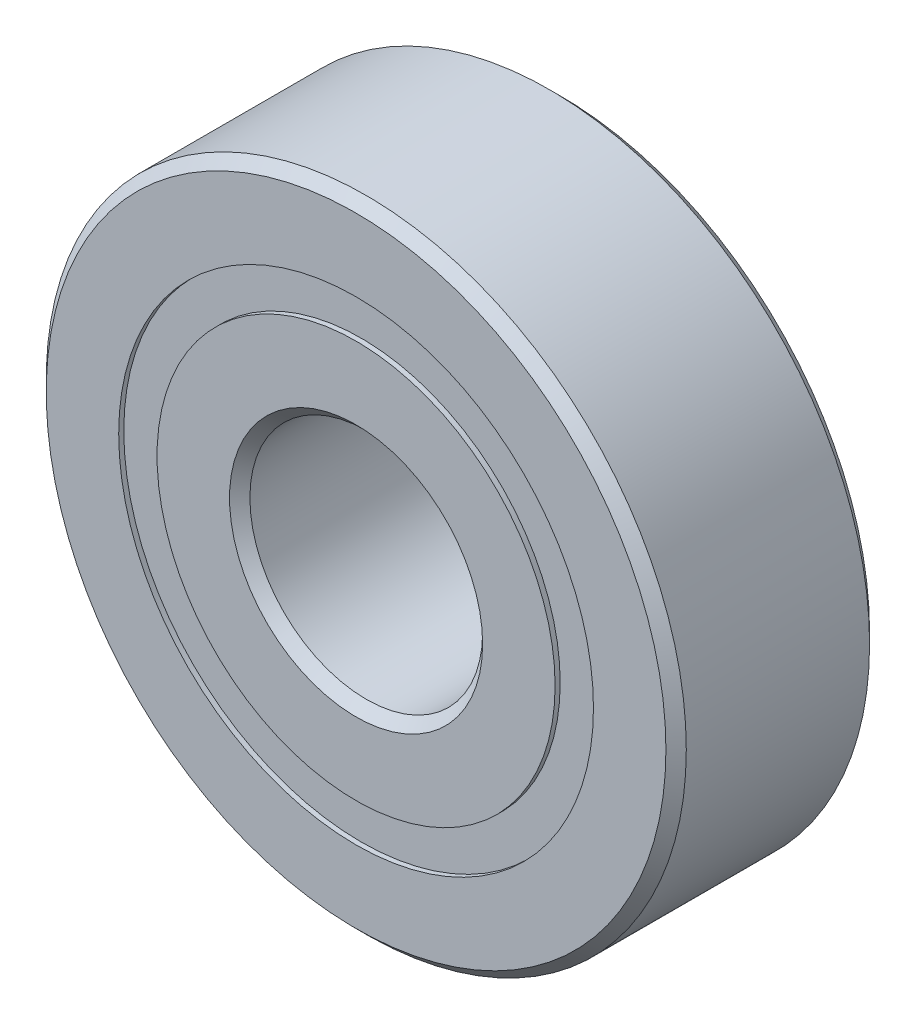
ISO-10303-21;
HEADER;
FILE_DESCRIPTION(('STEP AP214'),'2;1');
FILE_NAME('part.step','',(''),(''),'','','');
FILE_SCHEMA(('AUTOMOTIVE_DESIGN { 1 0 10303 214 1 1 1 1 }'));
ENDSEC;
DATA;
#1=APPLICATION_CONTEXT('core data for automotive mechanical design processes');
#2=APPLICATION_PROTOCOL_DEFINITION('international standard','automotive_design',2000,#1);
#3=PRODUCT_CONTEXT('',#1,'mechanical');
#4=PRODUCT('Part','Part','',(#3));
#5=PRODUCT_RELATED_PRODUCT_CATEGORY('part','',(#4));
#6=PRODUCT_DEFINITION_FORMATION('','',#4);
#7=PRODUCT_DEFINITION_CONTEXT('part definition',#1,'design');
#8=PRODUCT_DEFINITION('design','',#6,#7);
#9=PRODUCT_DEFINITION_SHAPE('','',#8);
#10=(LENGTH_UNIT() NAMED_UNIT(*) SI_UNIT(.MILLI.,.METRE.));
#11=(NAMED_UNIT(*) PLANE_ANGLE_UNIT() SI_UNIT($,.RADIAN.));
#12=(NAMED_UNIT(*) SI_UNIT($,.STERADIAN.) SOLID_ANGLE_UNIT());
#13=UNCERTAINTY_MEASURE_WITH_UNIT(LENGTH_MEASURE(1.E-05),#10,'distance_accuracy_value','');
#14=(GEOMETRIC_REPRESENTATION_CONTEXT(3) GLOBAL_UNCERTAINTY_ASSIGNED_CONTEXT((#13)) GLOBAL_UNIT_ASSIGNED_CONTEXT((#10,
#11,#12)) REPRESENTATION_CONTEXT('',''));
#15=CARTESIAN_POINT('',(0.,0.,0.));
#16=DIRECTION('',(0.,0.,1.));
#17=DIRECTION('',(1.,0.,0.));
#18=AXIS2_PLACEMENT_3D('',#15,#16,#17);
#19=CARTESIAN_POINT('',(0.,8.15934065934066,-3.325));
#20=DIRECTION('',(0.,0.,1.));
#21=DIRECTION('',(1.,0.,0.));
#22=AXIS2_PLACEMENT_3D('',#19,#20,#21);
#23=PLANE('',#22);
#24=CARTESIAN_POINT('',(0.,0.,-3.325));
#25=DIRECTION('',(0.,0.,1.));
#26=DIRECTION('',(1.,0.,0.));
#27=AXIS2_PLACEMENT_3D('',#24,#25,#26);
#28=CIRCLE('',#27,8.15934065934066);
#29=CARTESIAN_POINT('',(8.15934065934066,0.,-3.325));
#30=VERTEX_POINT('',#29);
#31=EDGE_CURVE('E55',#30,#30,#28,.T.);
#32=ORIENTED_EDGE('',*,*,#31,.F.);
#33=EDGE_LOOP('',(#32));
#34=FACE_BOUND('',#33,.T.);
#35=CARTESIAN_POINT('',(0.,0.,-3.325));
#36=DIRECTION('',(0.,0.,1.));
#37=DIRECTION('',(1.,0.,0.));
#38=AXIS2_PLACEMENT_3D('',#35,#36,#37);
#39=CIRCLE('',#38,6.84065934065934);
#40=CARTESIAN_POINT('',(6.84065934065934,0.,-3.325));
#41=VERTEX_POINT('',#40);
#42=EDGE_CURVE('E11',#41,#41,#39,.T.);
#43=ORIENTED_EDGE('',*,*,#42,.T.);
#44=EDGE_LOOP('',(#43));
#45=FACE_BOUND('',#44,.T.);
#46=ADVANCED_FACE('F41',(#34,#45),#23,.F.);
#47=CARTESIAN_POINT('',(0.,0.,3.5));
#48=DIRECTION('',(0.,0.,1.));
#49=DIRECTION('',(1.,0.,0.));
#50=AXIS2_PLACEMENT_3D('',#47,#48,#49);
#51=CYLINDRICAL_SURFACE('',#50,6.84065934065934);
#52=ORIENTED_EDGE('',*,*,#42,.F.);
#53=EDGE_LOOP('',(#52));
#54=FACE_BOUND('',#53,.T.);
#55=CARTESIAN_POINT('',(0.,0.,-1.68952158656808));
#56=DIRECTION('',(0.,0.,1.));
#57=DIRECTION('',(1.,0.,0.));
#58=AXIS2_PLACEMENT_3D('',#55,#56,#57);
#59=CIRCLE('',#58,6.84065934065934);
#60=CARTESIAN_POINT('',(6.84065934065934,0.,-1.68952158656808));
#61=VERTEX_POINT('',#60);
#62=EDGE_CURVE('E47',#61,#61,#59,.T.);
#63=ORIENTED_EDGE('',*,*,#62,.T.);
#64=EDGE_LOOP('',(#63));
#65=FACE_BOUND('',#64,.T.);
#66=ADVANCED_FACE('F64',(#54,#65),#51,.F.);
#67=CARTESIAN_POINT('',(0.,8.15934065934066,-1.68952158656808));
#68=DIRECTION('',(0.,0.,-1.));
#69=DIRECTION('',(-1.,0.,0.));
#70=AXIS2_PLACEMENT_3D('',#67,#68,#69);
#71=PLANE('',#70);
#72=ORIENTED_EDGE('',*,*,#62,.F.);
#73=EDGE_LOOP('',(#72));
#74=FACE_BOUND('',#73,.T.);
#75=CARTESIAN_POINT('',(0.,0.,-1.68952158656808));
#76=DIRECTION('',(0.,0.,1.));
#77=DIRECTION('',(1.,0.,0.));
#78=AXIS2_PLACEMENT_3D('',#75,#76,#77);
#79=CIRCLE('',#78,8.15934065934066);
#80=CARTESIAN_POINT('',(8.15934065934066,0.,-1.68952158656808));
#81=VERTEX_POINT('',#80);
#82=EDGE_CURVE('E51',#81,#81,#79,.T.);
#83=ORIENTED_EDGE('',*,*,#82,.T.);
#84=EDGE_LOOP('',(#83));
#85=FACE_BOUND('',#84,.T.);
#86=ADVANCED_FACE('F68',(#74,#85),#71,.F.);
#87=CARTESIAN_POINT('',(0.,0.,3.5));
#88=DIRECTION('',(0.,0.,1.));
#89=DIRECTION('',(1.,0.,0.));
#90=AXIS2_PLACEMENT_3D('',#87,#88,#89);
#91=CYLINDRICAL_SURFACE('',#90,8.15934065934066);
#92=ORIENTED_EDGE('',*,*,#82,.F.);
#93=EDGE_LOOP('',(#92));
#94=FACE_BOUND('',#93,.T.);
#95=ORIENTED_EDGE('',*,*,#31,.T.);
#96=EDGE_LOOP('',(#95));
#97=FACE_BOUND('',#96,.T.);
#98=ADVANCED_FACE('F61',(#94,#97),#91,.T.);
#99=CLOSED_SHELL('',(#46,#66,#86,#98));
#100=MANIFOLD_SOLID_BREP('B2',#99);
#101=CARTESIAN_POINT('',(0.,8.15934065934066,3.325));
#102=DIRECTION('',(0.,0.,-1.));
#103=DIRECTION('',(-1.,0.,0.));
#104=AXIS2_PLACEMENT_3D('',#101,#102,#103);
#105=PLANE('',#104);
#106=CARTESIAN_POINT('',(0.,0.,3.325));
#107=DIRECTION('',(0.,0.,1.));
#108=DIRECTION('',(1.,0.,0.));
#109=AXIS2_PLACEMENT_3D('',#106,#107,#108);
#110=CIRCLE('',#109,6.84065934065934);
#111=CARTESIAN_POINT('',(6.84065934065934,0.,3.325));
#112=VERTEX_POINT('',#111);
#113=EDGE_CURVE('E40',#112,#112,#110,.T.);
#114=ORIENTED_EDGE('',*,*,#113,.F.);
#115=EDGE_LOOP('',(#114));
#116=FACE_BOUND('',#115,.T.);
#117=CARTESIAN_POINT('',(0.,0.,3.325));
#118=DIRECTION('',(0.,0.,1.));
#119=DIRECTION('',(1.,0.,0.));
#120=AXIS2_PLACEMENT_3D('',#117,#118,#119);
#121=CIRCLE('',#120,8.15934065934066);
#122=CARTESIAN_POINT('',(8.15934065934066,0.,3.325));
#123=VERTEX_POINT('',#122);
#124=EDGE_CURVE('E122',#123,#123,#121,.T.);
#125=ORIENTED_EDGE('',*,*,#124,.T.);
#126=EDGE_LOOP('',(#125));
#127=FACE_BOUND('',#126,.T.);
#128=ADVANCED_FACE('F108',(#116,#127),#105,.F.);
#129=CARTESIAN_POINT('',(0.,0.,3.5));
#130=DIRECTION('',(0.,0.,1.));
#131=DIRECTION('',(1.,0.,0.));
#132=AXIS2_PLACEMENT_3D('',#129,#130,#131);
#133=CYLINDRICAL_SURFACE('',#132,6.84065934065934);
#134=CARTESIAN_POINT('',(0.,0.,1.68952158656808));
#135=DIRECTION('',(0.,0.,1.));
#136=DIRECTION('',(1.,0.,0.));
#137=AXIS2_PLACEMENT_3D('',#134,#135,#136);
#138=CIRCLE('',#137,6.84065934065934);
#139=CARTESIAN_POINT('',(6.84065934065934,0.,1.68952158656808));
#140=VERTEX_POINT('',#139);
#141=EDGE_CURVE('E114',#140,#140,#138,.T.);
#142=ORIENTED_EDGE('',*,*,#141,.F.);
#143=EDGE_LOOP('',(#142));
#144=FACE_BOUND('',#143,.T.);
#145=ORIENTED_EDGE('',*,*,#113,.T.);
#146=EDGE_LOOP('',(#145));
#147=FACE_BOUND('',#146,.T.);
#148=ADVANCED_FACE('F137',(#144,#147),#133,.F.);
#149=CARTESIAN_POINT('',(0.,8.15934065934066,1.68952158656808));
#150=DIRECTION('',(0.,0.,1.));
#151=DIRECTION('',(1.,0.,0.));
#152=AXIS2_PLACEMENT_3D('',#149,#150,#151);
#153=PLANE('',#152);
#154=CARTESIAN_POINT('',(0.,0.,1.68952158656808));
#155=DIRECTION('',(0.,0.,1.));
#156=DIRECTION('',(1.,0.,0.));
#157=AXIS2_PLACEMENT_3D('',#154,#155,#156);
#158=CIRCLE('',#157,8.15934065934066);
#159=CARTESIAN_POINT('',(8.15934065934066,0.,1.68952158656808));
#160=VERTEX_POINT('',#159);
#161=EDGE_CURVE('E118',#160,#160,#158,.T.);
#162=ORIENTED_EDGE('',*,*,#161,.F.);
#163=EDGE_LOOP('',(#162));
#164=FACE_BOUND('',#163,.T.);
#165=ORIENTED_EDGE('',*,*,#141,.T.);
#166=EDGE_LOOP('',(#165));
#167=FACE_BOUND('',#166,.T.);
#168=ADVANCED_FACE('F132',(#164,#167),#153,.F.);
#169=CARTESIAN_POINT('',(0.,0.,3.5));
#170=DIRECTION('',(0.,0.,1.));
#171=DIRECTION('',(1.,0.,0.));
#172=AXIS2_PLACEMENT_3D('',#169,#170,#171);
#173=CYLINDRICAL_SURFACE('',#172,8.15934065934066);
#174=ORIENTED_EDGE('',*,*,#124,.F.);
#175=EDGE_LOOP('',(#174));
#176=FACE_BOUND('',#175,.T.);
#177=ORIENTED_EDGE('',*,*,#161,.T.);
#178=EDGE_LOOP('',(#177));
#179=FACE_BOUND('',#178,.T.);
#180=ADVANCED_FACE('F129',(#176,#179),#173,.T.);
#181=CLOSED_SHELL('',(#128,#148,#168,#180));
#182=MANIFOLD_SOLID_BREP('B6',#181);
#183=CARTESIAN_POINT('',(-3.74999999999992,6.49519052838334,0.));
#184=DIRECTION('',(0.,0.,1.));
#185=DIRECTION('',(-0.499999999999989,0.866025403784445,0.));
#186=AXIS2_PLACEMENT_3D('',#183,#184,#185);
#187=SPHERICAL_SURFACE('',#186,1.68952158656808);
#188=CARTESIAN_POINT('',(-3.74999999999992,6.49519052838334,1.68952158656808));
#189=VERTEX_POINT('',#188);
#190=VERTEX_LOOP('',#189);
#191=FACE_BOUND('',#190,.T.);
#192=ADVANCED_FACE('F175',(#191),#187,.T.);
#193=CLOSED_SHELL('',(#192));
#194=MANIFOLD_SOLID_BREP('B35',#193);
#195=CARTESIAN_POINT('',(-6.49519052838325,3.75000000000008,0.));
#196=DIRECTION('',(0.,0.,1.));
#197=DIRECTION('',(-0.866025403784433,0.50000000000001,0.));
#198=AXIS2_PLACEMENT_3D('',#195,#196,#197);
#199=SPHERICAL_SURFACE('',#198,1.68952158656808);
#200=CARTESIAN_POINT('',(-6.49519052838325,3.75000000000008,1.68952158656808));
#201=VERTEX_POINT('',#200);
#202=VERTEX_LOOP('',#201);
#203=FACE_BOUND('',#202,.T.);
#204=ADVANCED_FACE('F195',(#203),#199,.T.);
#205=CLOSED_SHELL('',(#204));
#206=MANIFOLD_SOLID_BREP('B104',#205);
#207=CARTESIAN_POINT('',(-7.5,0.,0.));
#208=DIRECTION('',(0.,0.,1.));
#209=DIRECTION('',(-1.,0.,0.));
#210=AXIS2_PLACEMENT_3D('',#207,#208,#209);
#211=SPHERICAL_SURFACE('',#210,1.68952158656808);
#212=CARTESIAN_POINT('',(-7.5,0.,1.68952158656808));
#213=VERTEX_POINT('',#212);
#214=VERTEX_LOOP('',#213);
#215=FACE_BOUND('',#214,.T.);
#216=ADVANCED_FACE('F215',(#215),#211,.T.);
#217=CLOSED_SHELL('',(#216));
#218=MANIFOLD_SOLID_BREP('B171',#217);
#219=CARTESIAN_POINT('',(-6.49519052838332,-3.74999999999994,0.));
#220=DIRECTION('',(0.,0.,1.));
#221=DIRECTION('',(-0.866025403784443,-0.499999999999992,0.));
#222=AXIS2_PLACEMENT_3D('',#219,#220,#221);
#223=SPHERICAL_SURFACE('',#222,1.68952158656808);
#224=CARTESIAN_POINT('',(-6.49519052838332,-3.74999999999994,1.68952158656808));
#225=VERTEX_POINT('',#224);
#226=VERTEX_LOOP('',#225);
#227=FACE_BOUND('',#226,.T.);
#228=ADVANCED_FACE('F235',(#227),#223,.T.);
#229=CLOSED_SHELL('',(#228));
#230=MANIFOLD_SOLID_BREP('B191',#229);
#231=CARTESIAN_POINT('',(-3.75000000000005,-6.49519052838326,0.));
#232=DIRECTION('',(0.,0.,1.));
#233=DIRECTION('',(-0.500000000000007,-0.866025403784435,0.));
#234=AXIS2_PLACEMENT_3D('',#231,#232,#233);
#235=SPHERICAL_SURFACE('',#234,1.68952158656808);
#236=CARTESIAN_POINT('',(-3.75000000000005,-6.49519052838326,1.68952158656808));
#237=VERTEX_POINT('',#236);
#238=VERTEX_LOOP('',#237);
#239=FACE_BOUND('',#238,.T.);
#240=ADVANCED_FACE('F255',(#239),#235,.T.);
#241=CLOSED_SHELL('',(#240));
#242=MANIFOLD_SOLID_BREP('B211',#241);
#243=CARTESIAN_POINT('',(0.,-7.5,0.));
#244=DIRECTION('',(0.,0.,1.));
#245=DIRECTION('',(0.,-1.,0.));
#246=AXIS2_PLACEMENT_3D('',#243,#244,#245);
#247=SPHERICAL_SURFACE('',#246,1.68952158656808);
#248=CARTESIAN_POINT('',(0.,-7.5,1.68952158656808));
#249=VERTEX_POINT('',#248);
#250=VERTEX_LOOP('',#249);
#251=FACE_BOUND('',#250,.T.);
#252=ADVANCED_FACE('F275',(#251),#247,.T.);
#253=CLOSED_SHELL('',(#252));
#254=MANIFOLD_SOLID_BREP('B231',#253);
#255=CARTESIAN_POINT('',(3.74999999999996,-6.49519052838331,0.));
#256=DIRECTION('',(0.,0.,1.));
#257=DIRECTION('',(0.499999999999995,-0.866025403784442,0.));
#258=AXIS2_PLACEMENT_3D('',#255,#256,#257);
#259=SPHERICAL_SURFACE('',#258,1.68952158656808);
#260=CARTESIAN_POINT('',(3.74999999999996,-6.49519052838331,1.68952158656808));
#261=VERTEX_POINT('',#260);
#262=VERTEX_LOOP('',#261);
#263=FACE_BOUND('',#262,.T.);
#264=ADVANCED_FACE('F295',(#263),#259,.T.);
#265=CLOSED_SHELL('',(#264));
#266=MANIFOLD_SOLID_BREP('B251',#265);
#267=CARTESIAN_POINT('',(6.49519052838327,-3.75000000000003,0.));
#268=DIRECTION('',(0.,0.,1.));
#269=DIRECTION('',(0.866025403784436,-0.500000000000004,0.));
#270=AXIS2_PLACEMENT_3D('',#267,#268,#269);
#271=SPHERICAL_SURFACE('',#270,1.68952158656808);
#272=CARTESIAN_POINT('',(6.49519052838327,-3.75000000000003,1.68952158656808));
#273=VERTEX_POINT('',#272);
#274=VERTEX_LOOP('',#273);
#275=FACE_BOUND('',#274,.T.);
#276=ADVANCED_FACE('F315',(#275),#271,.T.);
#277=CLOSED_SHELL('',(#276));
#278=MANIFOLD_SOLID_BREP('B271',#277);
#279=CARTESIAN_POINT('',(7.5,0.,0.));
#280=DIRECTION('',(0.,0.,1.));
#281=DIRECTION('',(1.,0.,0.));
#282=AXIS2_PLACEMENT_3D('',#279,#280,#281);
#283=SPHERICAL_SURFACE('',#282,1.68952158656808);
#284=CARTESIAN_POINT('',(7.5,0.,1.68952158656808));
#285=VERTEX_POINT('',#284);
#286=VERTEX_LOOP('',#285);
#287=FACE_BOUND('',#286,.T.);
#288=ADVANCED_FACE('F335',(#287),#283,.T.);
#289=CLOSED_SHELL('',(#288));
#290=MANIFOLD_SOLID_BREP('B291',#289);
#291=CARTESIAN_POINT('',(6.4951905283833,3.74999999999998,0.));
#292=DIRECTION('',(0.,0.,1.));
#293=DIRECTION('',(0.86602540378444,0.499999999999998,0.));
#294=AXIS2_PLACEMENT_3D('',#291,#292,#293);
#295=SPHERICAL_SURFACE('',#294,1.68952158656808);
#296=CARTESIAN_POINT('',(6.4951905283833,3.74999999999998,1.68952158656808));
#297=VERTEX_POINT('',#296);
#298=VERTEX_LOOP('',#297);
#299=FACE_BOUND('',#298,.T.);
#300=ADVANCED_FACE('F355',(#299),#295,.T.);
#301=CLOSED_SHELL('',(#300));
#302=MANIFOLD_SOLID_BREP('B311',#301);
#303=CARTESIAN_POINT('',(3.75000000000001,6.49519052838328,0.));
#304=DIRECTION('',(0.,0.,1.));
#305=DIRECTION('',(0.500000000000001,0.866025403784438,0.));
#306=AXIS2_PLACEMENT_3D('',#303,#304,#305);
#307=SPHERICAL_SURFACE('',#306,1.68952158656808);
#308=CARTESIAN_POINT('',(3.75000000000001,6.49519052838328,1.68952158656808));
#309=VERTEX_POINT('',#308);
#310=VERTEX_LOOP('',#309);
#311=FACE_BOUND('',#310,.T.);
#312=ADVANCED_FACE('F375',(#311),#307,.T.);
#313=CLOSED_SHELL('',(#312));
#314=MANIFOLD_SOLID_BREP('B331',#313);
#315=CARTESIAN_POINT('',(0.,7.5,0.));
#316=DIRECTION('',(0.,0.,1.));
#317=DIRECTION('',(0.,1.,0.));
#318=AXIS2_PLACEMENT_3D('',#315,#316,#317);
#319=SPHERICAL_SURFACE('',#318,1.68952158656808);
#320=CARTESIAN_POINT('',(0.,7.5,1.68952158656808));
#321=VERTEX_POINT('',#320);
#322=VERTEX_LOOP('',#321);
#323=FACE_BOUND('',#322,.T.);
#324=ADVANCED_FACE('F397',(#323),#319,.T.);
#325=CLOSED_SHELL('',(#324));
#326=MANIFOLD_SOLID_BREP('B351',#325);
#327=CARTESIAN_POINT('',(0.,6.84065934065934,3.5));
#328=DIRECTION('',(0.,0.,-1.));
#329=DIRECTION('',(-1.,0.,0.));
#330=AXIS2_PLACEMENT_3D('',#327,#328,#329);
#331=PLANE('',#330);
#332=CARTESIAN_POINT('',(0.,0.,3.5));
#333=DIRECTION('',(0.,0.,1.));
#334=DIRECTION('',(1.,0.,0.));
#335=AXIS2_PLACEMENT_3D('',#332,#333,#334);
#336=CIRCLE('',#335,4.35);
#337=CARTESIAN_POINT('',(4.35,0.,3.5));
#338=VERTEX_POINT('',#337);
#339=EDGE_CURVE('E444',#338,#338,#336,.T.);
#340=ORIENTED_EDGE('',*,*,#339,.F.);
#341=EDGE_LOOP('',(#340));
#342=FACE_BOUND('',#341,.T.);
#343=CARTESIAN_POINT('',(0.,0.,3.5));
#344=DIRECTION('',(0.,0.,1.));
#345=DIRECTION('',(1.,0.,0.));
#346=AXIS2_PLACEMENT_3D('',#343,#344,#345);
#347=CIRCLE('',#346,6.84065934065934);
#348=CARTESIAN_POINT('',(6.84065934065934,0.,3.5));
#349=VERTEX_POINT('',#348);
#350=EDGE_CURVE('E396',#349,#349,#347,.T.);
#351=ORIENTED_EDGE('',*,*,#350,.T.);
#352=EDGE_LOOP('',(#351));
#353=FACE_BOUND('',#352,.T.);
#354=ADVANCED_FACE('F416',(#342,#353),#331,.F.);
#355=CARTESIAN_POINT('',(0.,0.,3.5));
#356=DIRECTION('',(0.,0.,1.));
#357=DIRECTION('',(1.,0.,0.));
#358=AXIS2_PLACEMENT_3D('',#355,#356,#357);
#359=CYLINDRICAL_SURFACE('',#358,6.84065934065934);
#360=ORIENTED_EDGE('',*,*,#350,.F.);
#361=EDGE_LOOP('',(#360));
#362=FACE_BOUND('',#361,.T.);
#363=CARTESIAN_POINT('',(0.,0.,1.55555555555556));
#364=DIRECTION('',(0.,0.,1.));
#365=DIRECTION('',(1.,0.,0.));
#366=AXIS2_PLACEMENT_3D('',#363,#364,#365);
#367=CIRCLE('',#366,6.84065934065934);
#368=CARTESIAN_POINT('',(6.84065934065934,0.,1.55555555555556));
#369=VERTEX_POINT('',#368);
#370=EDGE_CURVE('E422',#369,#369,#367,.T.);
#371=ORIENTED_EDGE('',*,*,#370,.T.);
#372=EDGE_LOOP('',(#371));
#373=FACE_BOUND('',#372,.T.);
#374=ADVANCED_FACE('F451',(#362,#373),#359,.T.);
#375=CARTESIAN_POINT('',(0.,0.,0.));
#376=DIRECTION('',(0.,0.,1.));
#377=DIRECTION('',(1.,0.,0.));
#378=AXIS2_PLACEMENT_3D('',#375,#376,#377);
#379=TOROIDAL_SURFACE('',#378,7.49999999999999,1.68952158656808);
#380=ORIENTED_EDGE('',*,*,#370,.F.);
#381=EDGE_LOOP('',(#380));
#382=FACE_BOUND('',#381,.T.);
#383=CARTESIAN_POINT('',(0.,0.,-1.55555555555556));
#384=DIRECTION('',(0.,0.,1.));
#385=DIRECTION('',(1.,0.,0.));
#386=AXIS2_PLACEMENT_3D('',#383,#384,#385);
#387=CIRCLE('',#386,6.84065934065934);
#388=CARTESIAN_POINT('',(6.84065934065934,0.,-1.55555555555556));
#389=VERTEX_POINT('',#388);
#390=EDGE_CURVE('E426',#389,#389,#387,.T.);
#391=ORIENTED_EDGE('',*,*,#390,.T.);
#392=EDGE_LOOP('',(#391));
#393=FACE_BOUND('',#392,.T.);
#394=ADVANCED_FACE('F455',(#382,#393),#379,.F.);
#395=CARTESIAN_POINT('',(0.,0.,3.5));
#396=DIRECTION('',(0.,0.,1.));
#397=DIRECTION('',(1.,0.,0.));
#398=AXIS2_PLACEMENT_3D('',#395,#396,#397);
#399=CYLINDRICAL_SURFACE('',#398,6.84065934065934);
#400=ORIENTED_EDGE('',*,*,#390,.F.);
#401=EDGE_LOOP('',(#400));
#402=FACE_BOUND('',#401,.T.);
#403=CARTESIAN_POINT('',(0.,0.,-3.5));
#404=DIRECTION('',(0.,0.,1.));
#405=DIRECTION('',(1.,0.,0.));
#406=AXIS2_PLACEMENT_3D('',#403,#404,#405);
#407=CIRCLE('',#406,6.84065934065934);
#408=CARTESIAN_POINT('',(6.84065934065934,0.,-3.5));
#409=VERTEX_POINT('',#408);
#410=EDGE_CURVE('E430',#409,#409,#407,.T.);
#411=ORIENTED_EDGE('',*,*,#410,.T.);
#412=EDGE_LOOP('',(#411));
#413=FACE_BOUND('',#412,.T.);
#414=ADVANCED_FACE('F460',(#402,#413),#399,.T.);
#415=CARTESIAN_POINT('',(0.,4.35,-3.5));
#416=DIRECTION('',(0.,0.,1.));
#417=DIRECTION('',(1.,0.,0.));
#418=AXIS2_PLACEMENT_3D('',#415,#416,#417);
#419=PLANE('',#418);
#420=ORIENTED_EDGE('',*,*,#410,.F.);
#421=EDGE_LOOP('',(#420));
#422=FACE_BOUND('',#421,.T.);
#423=CARTESIAN_POINT('',(0.,0.,-3.5));
#424=DIRECTION('',(0.,0.,1.));
#425=DIRECTION('',(1.,0.,0.));
#426=AXIS2_PLACEMENT_3D('',#423,#424,#425);
#427=CIRCLE('',#426,4.35);
#428=CARTESIAN_POINT('',(4.35,0.,-3.5));
#429=VERTEX_POINT('',#428);
#430=EDGE_CURVE('E435',#429,#429,#427,.T.);
#431=ORIENTED_EDGE('',*,*,#430,.T.);
#432=EDGE_LOOP('',(#431));
#433=FACE_BOUND('',#432,.T.);
#434=ADVANCED_FACE('F466',(#422,#433),#419,.F.);
#435=CARTESIAN_POINT('',(0.,0.,-3.15));
#436=DIRECTION('',(0.,0.,-1.));
#437=DIRECTION('',(-1.,0.,0.));
#438=AXIS2_PLACEMENT_3D('',#435,#436,#437);
#439=CONICAL_SURFACE('',#438,4.,0.78539816339745);
#440=ORIENTED_EDGE('',*,*,#430,.F.);
#441=EDGE_LOOP('',(#440));
#442=FACE_BOUND('',#441,.T.);
#443=CARTESIAN_POINT('',(0.,0.,-3.15));
#444=DIRECTION('',(0.,0.,1.));
#445=DIRECTION('',(1.,0.,0.));
#446=AXIS2_PLACEMENT_3D('',#443,#444,#445);
#447=CIRCLE('',#446,4.);
#448=CARTESIAN_POINT('',(4.,0.,-3.15));
#449=VERTEX_POINT('',#448);
#450=EDGE_CURVE('E438',#449,#449,#447,.T.);
#451=ORIENTED_EDGE('',*,*,#450,.T.);
#452=EDGE_LOOP('',(#451));
#453=FACE_BOUND('',#452,.T.);
#454=ADVANCED_FACE('F470',(#442,#453),#439,.F.);
#455=CARTESIAN_POINT('',(0.,0.,3.5));
#456=DIRECTION('',(0.,0.,1.));
#457=DIRECTION('',(1.,0.,0.));
#458=AXIS2_PLACEMENT_3D('',#455,#456,#457);
#459=CYLINDRICAL_SURFACE('',#458,4.);
#460=ORIENTED_EDGE('',*,*,#450,.F.);
#461=EDGE_LOOP('',(#460));
#462=FACE_BOUND('',#461,.T.);
#463=CARTESIAN_POINT('',(0.,0.,3.15));
#464=DIRECTION('',(0.,0.,1.));
#465=DIRECTION('',(1.,0.,0.));
#466=AXIS2_PLACEMENT_3D('',#463,#464,#465);
#467=CIRCLE('',#466,4.);
#468=CARTESIAN_POINT('',(4.,0.,3.15));
#469=VERTEX_POINT('',#468);
#470=EDGE_CURVE('E441',#469,#469,#467,.T.);
#471=ORIENTED_EDGE('',*,*,#470,.T.);
#472=EDGE_LOOP('',(#471));
#473=FACE_BOUND('',#472,.T.);
#474=ADVANCED_FACE('F474',(#462,#473),#459,.F.);
#475=CARTESIAN_POINT('',(0.,0.,3.5));
#476=DIRECTION('',(0.,0.,1.));
#477=DIRECTION('',(1.,0.,0.));
#478=AXIS2_PLACEMENT_3D('',#475,#476,#477);
#479=CONICAL_SURFACE('',#478,4.35,0.785398163397448);
#480=ORIENTED_EDGE('',*,*,#470,.F.);
#481=EDGE_LOOP('',(#480));
#482=FACE_BOUND('',#481,.T.);
#483=ORIENTED_EDGE('',*,*,#339,.T.);
#484=EDGE_LOOP('',(#483));
#485=FACE_BOUND('',#484,.T.);
#486=ADVANCED_FACE('F448',(#482,#485),#479,.F.);
#487=CLOSED_SHELL('',(#354,#374,#394,#414,#434,#454,#474,#486));
#488=MANIFOLD_SOLID_BREP('B371',#487);
#489=CARTESIAN_POINT('',(0.,0.,3.15));
#490=DIRECTION('',(0.,0.,-1.));
#491=DIRECTION('',(-1.,0.,0.));
#492=AXIS2_PLACEMENT_3D('',#489,#490,#491);
#493=CONICAL_SURFACE('',#492,11.,0.785398163397448);
#494=CARTESIAN_POINT('',(0.,0.,3.5));
#495=DIRECTION('',(0.,0.,1.));
#496=DIRECTION('',(1.,0.,0.));
#497=AXIS2_PLACEMENT_3D('',#494,#495,#496);
#498=CIRCLE('',#497,10.65);
#499=CARTESIAN_POINT('',(10.65,0.,3.5));
#500=VERTEX_POINT('',#499);
#501=EDGE_CURVE('E565',#500,#500,#498,.T.);
#502=ORIENTED_EDGE('',*,*,#501,.F.);
#503=EDGE_LOOP('',(#502));
#504=FACE_BOUND('',#503,.T.);
#505=CARTESIAN_POINT('',(0.,0.,3.15));
#506=DIRECTION('',(0.,0.,1.));
#507=DIRECTION('',(1.,0.,0.));
#508=AXIS2_PLACEMENT_3D('',#505,#506,#507);
#509=CIRCLE('',#508,11.);
#510=CARTESIAN_POINT('',(11.,0.,3.15));
#511=VERTEX_POINT('',#510);
#512=EDGE_CURVE('E415',#511,#511,#509,.T.);
#513=ORIENTED_EDGE('',*,*,#512,.T.);
#514=EDGE_LOOP('',(#513));
#515=FACE_BOUND('',#514,.T.);
#516=ADVANCED_FACE('F537',(#504,#515),#493,.T.);
#517=CARTESIAN_POINT('',(0.,0.,3.5));
#518=DIRECTION('',(0.,0.,1.));
#519=DIRECTION('',(1.,0.,0.));
#520=AXIS2_PLACEMENT_3D('',#517,#518,#519);
#521=CYLINDRICAL_SURFACE('',#520,11.);
#522=ORIENTED_EDGE('',*,*,#512,.F.);
#523=EDGE_LOOP('',(#522));
#524=FACE_BOUND('',#523,.T.);
#525=CARTESIAN_POINT('',(0.,0.,-3.15));
#526=DIRECTION('',(0.,0.,1.));
#527=DIRECTION('',(1.,0.,0.));
#528=AXIS2_PLACEMENT_3D('',#525,#526,#527);
#529=CIRCLE('',#528,11.);
#530=CARTESIAN_POINT('',(11.,0.,-3.15));
#531=VERTEX_POINT('',#530);
#532=EDGE_CURVE('E543',#531,#531,#529,.T.);
#533=ORIENTED_EDGE('',*,*,#532,.T.);
#534=EDGE_LOOP('',(#533));
#535=FACE_BOUND('',#534,.T.);
#536=ADVANCED_FACE('F572',(#524,#535),#521,.T.);
#537=CARTESIAN_POINT('',(0.,0.,-3.5));
#538=DIRECTION('',(0.,0.,1.));
#539=DIRECTION('',(1.,0.,0.));
#540=AXIS2_PLACEMENT_3D('',#537,#538,#539);
#541=CONICAL_SURFACE('',#540,10.65,0.785398163397448);
#542=ORIENTED_EDGE('',*,*,#532,.F.);
#543=EDGE_LOOP('',(#542));
#544=FACE_BOUND('',#543,.T.);
#545=CARTESIAN_POINT('',(0.,0.,-3.5));
#546=DIRECTION('',(0.,0.,1.));
#547=DIRECTION('',(1.,0.,0.));
#548=AXIS2_PLACEMENT_3D('',#545,#546,#547);
#549=CIRCLE('',#548,10.65);
#550=CARTESIAN_POINT('',(10.65,0.,-3.5));
#551=VERTEX_POINT('',#550);
#552=EDGE_CURVE('E547',#551,#551,#549,.T.);
#553=ORIENTED_EDGE('',*,*,#552,.T.);
#554=EDGE_LOOP('',(#553));
#555=FACE_BOUND('',#554,.T.);
#556=ADVANCED_FACE('F576',(#544,#555),#541,.T.);
#557=CARTESIAN_POINT('',(0.,10.65,-3.5));
#558=DIRECTION('',(0.,0.,1.));
#559=DIRECTION('',(1.,0.,0.));
#560=AXIS2_PLACEMENT_3D('',#557,#558,#559);
#561=PLANE('',#560);
#562=ORIENTED_EDGE('',*,*,#552,.F.);
#563=EDGE_LOOP('',(#562));
#564=FACE_BOUND('',#563,.T.);
#565=CARTESIAN_POINT('',(0.,0.,-3.5));
#566=DIRECTION('',(0.,0.,1.));
#567=DIRECTION('',(1.,0.,0.));
#568=AXIS2_PLACEMENT_3D('',#565,#566,#567);
#569=CIRCLE('',#568,8.15934065934066);
#570=CARTESIAN_POINT('',(8.15934065934066,0.,-3.5));
#571=VERTEX_POINT('',#570);
#572=EDGE_CURVE('E551',#571,#571,#569,.T.);
#573=ORIENTED_EDGE('',*,*,#572,.T.);
#574=EDGE_LOOP('',(#573));
#575=FACE_BOUND('',#574,.T.);
#576=ADVANCED_FACE('F581',(#564,#575),#561,.F.);
#577=CARTESIAN_POINT('',(0.,0.,3.5));
#578=DIRECTION('',(0.,0.,1.));
#579=DIRECTION('',(1.,0.,0.));
#580=AXIS2_PLACEMENT_3D('',#577,#578,#579);
#581=CYLINDRICAL_SURFACE('',#580,8.15934065934066);
#582=ORIENTED_EDGE('',*,*,#572,.F.);
#583=EDGE_LOOP('',(#582));
#584=FACE_BOUND('',#583,.T.);
#585=CARTESIAN_POINT('',(0.,0.,-1.55555555555556));
#586=DIRECTION('',(0.,0.,1.));
#587=DIRECTION('',(1.,0.,0.));
#588=AXIS2_PLACEMENT_3D('',#585,#586,#587);
#589=CIRCLE('',#588,8.15934065934066);
#590=CARTESIAN_POINT('',(8.15934065934066,0.,-1.55555555555556));
#591=VERTEX_POINT('',#590);
#592=EDGE_CURVE('E556',#591,#591,#589,.T.);
#593=ORIENTED_EDGE('',*,*,#592,.T.);
#594=EDGE_LOOP('',(#593));
#595=FACE_BOUND('',#594,.T.);
#596=ADVANCED_FACE('F587',(#584,#595),#581,.F.);
#597=CARTESIAN_POINT('',(0.,0.,0.));
#598=DIRECTION('',(0.,0.,1.));
#599=DIRECTION('',(1.,0.,0.));
#600=AXIS2_PLACEMENT_3D('',#597,#598,#599);
#601=TOROIDAL_SURFACE('',#600,7.5,1.68952158656808);
#602=ORIENTED_EDGE('',*,*,#592,.F.);
#603=EDGE_LOOP('',(#602));
#604=FACE_BOUND('',#603,.T.);
#605=CARTESIAN_POINT('',(0.,0.,1.55555555555555));
#606=DIRECTION('',(0.,0.,1.));
#607=DIRECTION('',(1.,0.,0.));
#608=AXIS2_PLACEMENT_3D('',#605,#606,#607);
#609=CIRCLE('',#608,8.15934065934066);
#610=CARTESIAN_POINT('',(8.15934065934066,0.,1.55555555555555));
#611=VERTEX_POINT('',#610);
#612=EDGE_CURVE('E559',#611,#611,#609,.T.);
#613=ORIENTED_EDGE('',*,*,#612,.T.);
#614=EDGE_LOOP('',(#613));
#615=FACE_BOUND('',#614,.T.);
#616=ADVANCED_FACE('F591',(#604,#615),#601,.F.);
#617=CARTESIAN_POINT('',(0.,0.,3.5));
#618=DIRECTION('',(0.,0.,1.));
#619=DIRECTION('',(1.,0.,0.));
#620=AXIS2_PLACEMENT_3D('',#617,#618,#619);
#621=CYLINDRICAL_SURFACE('',#620,8.15934065934066);
#622=ORIENTED_EDGE('',*,*,#612,.F.);
#623=EDGE_LOOP('',(#622));
#624=FACE_BOUND('',#623,.T.);
#625=CARTESIAN_POINT('',(0.,0.,3.5));
#626=DIRECTION('',(0.,0.,1.));
#627=DIRECTION('',(1.,0.,0.));
#628=AXIS2_PLACEMENT_3D('',#625,#626,#627);
#629=CIRCLE('',#628,8.15934065934066);
#630=CARTESIAN_POINT('',(8.15934065934066,0.,3.5));
#631=VERTEX_POINT('',#630);
#632=EDGE_CURVE('E562',#631,#631,#629,.T.);
#633=ORIENTED_EDGE('',*,*,#632,.T.);
#634=EDGE_LOOP('',(#633));
#635=FACE_BOUND('',#634,.T.);
#636=ADVANCED_FACE('F595',(#624,#635),#621,.F.);
#637=CARTESIAN_POINT('',(0.,10.65,3.5));
#638=DIRECTION('',(0.,0.,-1.));
#639=DIRECTION('',(-1.,0.,0.));
#640=AXIS2_PLACEMENT_3D('',#637,#638,#639);
#641=PLANE('',#640);
#642=ORIENTED_EDGE('',*,*,#632,.F.);
#643=EDGE_LOOP('',(#642));
#644=FACE_BOUND('',#643,.T.);
#645=ORIENTED_EDGE('',*,*,#501,.T.);
#646=EDGE_LOOP('',(#645));
#647=FACE_BOUND('',#646,.T.);
#648=ADVANCED_FACE('F569',(#644,#647),#641,.F.);
#649=CLOSED_SHELL('',(#516,#536,#556,#576,#596,#616,#636,#648));
#650=MANIFOLD_SOLID_BREP('B391',#649);
#651=ADVANCED_BREP_SHAPE_REPRESENTATION('',(#18,#100,#182,#194,#206,#218,#230,#242,#254,#266,
#278,#290,#302,#314,#326,#488,#650),#14);
#652=SHAPE_DEFINITION_REPRESENTATION(#9,#651);
ENDSEC;
END-ISO-10303-21;
